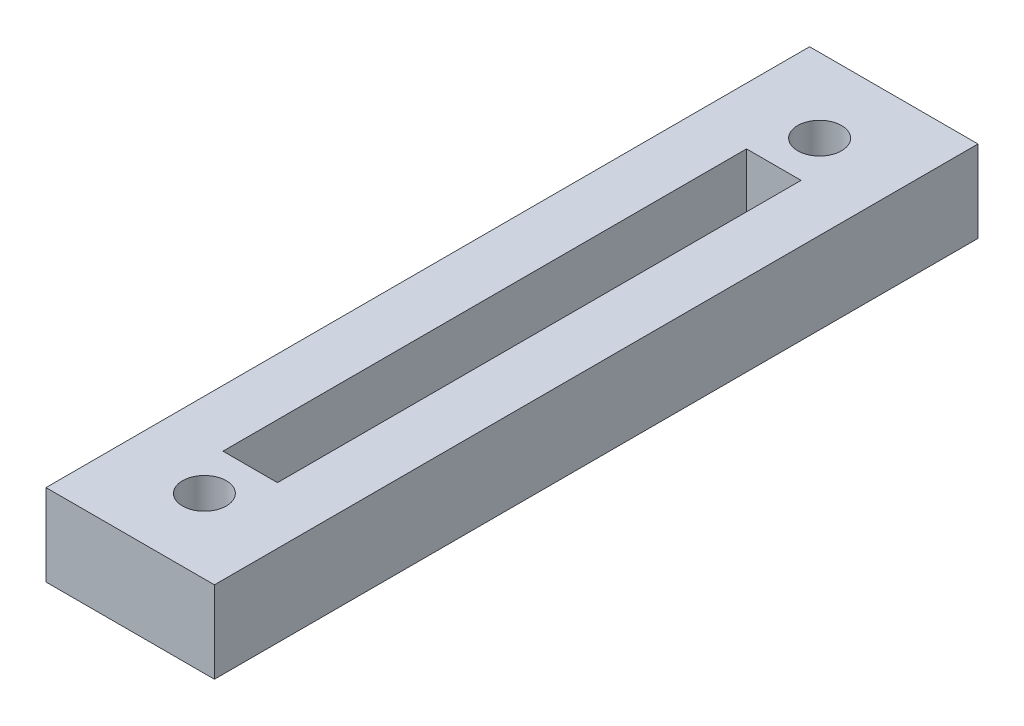
ISO-10303-21;
HEADER;
FILE_DESCRIPTION(('STEP AP214'),'2;1');
FILE_NAME('part.step','',(''),(''),'','','');
FILE_SCHEMA(('AUTOMOTIVE_DESIGN { 1 0 10303 214 1 1 1 1 }'));
ENDSEC;
DATA;
#1=APPLICATION_CONTEXT('core data for automotive mechanical design processes');
#2=APPLICATION_PROTOCOL_DEFINITION('international standard','automotive_design',2000,#1);
#3=PRODUCT_CONTEXT('',#1,'mechanical');
#4=PRODUCT('Part','Part','',(#3));
#5=PRODUCT_RELATED_PRODUCT_CATEGORY('part','',(#4));
#6=PRODUCT_DEFINITION_FORMATION('','',#4);
#7=PRODUCT_DEFINITION_CONTEXT('part definition',#1,'design');
#8=PRODUCT_DEFINITION('design','',#6,#7);
#9=PRODUCT_DEFINITION_SHAPE('','',#8);
#10=(LENGTH_UNIT() NAMED_UNIT(*) SI_UNIT(.MILLI.,.METRE.));
#11=(NAMED_UNIT(*) PLANE_ANGLE_UNIT() SI_UNIT($,.RADIAN.));
#12=(NAMED_UNIT(*) SI_UNIT($,.STERADIAN.) SOLID_ANGLE_UNIT());
#13=UNCERTAINTY_MEASURE_WITH_UNIT(LENGTH_MEASURE(1.E-05),#10,'distance_accuracy_value','');
#14=(GEOMETRIC_REPRESENTATION_CONTEXT(3) GLOBAL_UNCERTAINTY_ASSIGNED_CONTEXT((#13)) GLOBAL_UNIT_ASSIGNED_CONTEXT((#10,
#11,#12)) REPRESENTATION_CONTEXT('',''));
#15=CARTESIAN_POINT('',(0.,0.,0.));
#16=DIRECTION('',(0.,0.,1.));
#17=DIRECTION('',(1.,0.,0.));
#18=AXIS2_PLACEMENT_3D('',#15,#16,#17);
#19=CARTESIAN_POINT('',(0.,9.525,0.));
#20=DIRECTION('',(0.,-1.,0.));
#21=DIRECTION('',(0.,0.,-1.));
#22=AXIS2_PLACEMENT_3D('',#19,#20,#21);
#23=PLANE('',#22);
#24=CARTESIAN_POINT('',(9.8044,9.525,-80.264));
#25=DIRECTION('',(0.,1.,0.));
#26=DIRECTION('',(0.,0.,1.));
#27=AXIS2_PLACEMENT_3D('',#24,#25,#26);
#28=CIRCLE('',#27,2.5527);
#29=CARTESIAN_POINT('',(9.8044,9.525,-77.7113));
#30=VERTEX_POINT('',#29);
#31=EDGE_CURVE('E227',#30,#30,#28,.T.);
#32=ORIENTED_EDGE('',*,*,#31,.F.);
#33=EDGE_LOOP('',(#32));
#34=FACE_BOUND('',#33,.T.);
#35=CARTESIAN_POINT('',(9.8044,9.525,-8.63599999999999));
#36=DIRECTION('',(0.,1.,0.));
#37=DIRECTION('',(0.,0.,1.));
#38=AXIS2_PLACEMENT_3D('',#35,#36,#37);
#39=CIRCLE('',#38,2.5527);
#40=CARTESIAN_POINT('',(9.8044,9.525,-6.0833));
#41=VERTEX_POINT('',#40);
#42=EDGE_CURVE('E135',#41,#41,#39,.T.);
#43=ORIENTED_EDGE('',*,*,#42,.F.);
#44=EDGE_LOOP('',(#43));
#45=FACE_BOUND('',#44,.T.);
#46=DIRECTION('',(-1.,0.,0.));
#47=VECTOR('',#46,1.);
#48=CARTESIAN_POINT('',(6.62939999999999,9.525,-74.93));
#49=LINE('',#48,#47);
#50=CARTESIAN_POINT('',(12.9794,9.525,-74.93));
#51=VERTEX_POINT('',#50);
#52=CARTESIAN_POINT('',(6.62939999999999,9.525,-74.93));
#53=VERTEX_POINT('',#52);
#54=EDGE_CURVE('E141',#51,#53,#49,.T.);
#55=ORIENTED_EDGE('',*,*,#54,.F.);
#56=DIRECTION('',(0.,0.,-1.));
#57=VECTOR('',#56,1.);
#58=CARTESIAN_POINT('',(12.9794,9.525,-74.93));
#59=LINE('',#58,#57);
#60=CARTESIAN_POINT('',(12.9794,9.525,-13.97));
#61=VERTEX_POINT('',#60);
#62=EDGE_CURVE('E50',#61,#51,#59,.T.);
#63=ORIENTED_EDGE('',*,*,#62,.F.);
#64=DIRECTION('',(1.,0.,0.));
#65=VECTOR('',#64,1.);
#66=CARTESIAN_POINT('',(6.6294,9.525,-13.97));
#67=LINE('',#66,#65);
#68=CARTESIAN_POINT('',(6.6294,9.525,-13.97));
#69=VERTEX_POINT('',#68);
#70=EDGE_CURVE('E129',#69,#61,#67,.T.);
#71=ORIENTED_EDGE('',*,*,#70,.F.);
#72=DIRECTION('',(0.,0.,1.));
#73=VECTOR('',#72,1.);
#74=CARTESIAN_POINT('',(6.62939999999999,9.525,-74.93));
#75=LINE('',#74,#73);
#76=EDGE_CURVE('E132',#53,#69,#75,.T.);
#77=ORIENTED_EDGE('',*,*,#76,.F.);
#78=EDGE_LOOP('',(#55,#63,#71,#77));
#79=FACE_BOUND('',#78,.T.);
#80=DIRECTION('',(0.,0.,1.));
#81=VECTOR('',#80,1.);
#82=CARTESIAN_POINT('',(0.,9.525,0.));
#83=LINE('',#82,#81);
#84=CARTESIAN_POINT('',(0.,9.525,-88.9));
#85=VERTEX_POINT('',#84);
#86=CARTESIAN_POINT('',(0.,9.525,0.));
#87=VERTEX_POINT('',#86);
#88=EDGE_CURVE('E151',#85,#87,#83,.T.);
#89=ORIENTED_EDGE('',*,*,#88,.T.);
#90=DIRECTION('',(1.,0.,0.));
#91=VECTOR('',#90,1.);
#92=CARTESIAN_POINT('',(0.,9.525,0.));
#93=LINE('',#92,#91);
#94=CARTESIAN_POINT('',(19.6088,9.525,0.));
#95=VERTEX_POINT('',#94);
#96=EDGE_CURVE('E87',#87,#95,#93,.T.);
#97=ORIENTED_EDGE('',*,*,#96,.T.);
#98=DIRECTION('',(0.,0.,-1.));
#99=VECTOR('',#98,1.);
#100=CARTESIAN_POINT('',(19.6088,9.525,0.));
#101=LINE('',#100,#99);
#102=CARTESIAN_POINT('',(19.6088,9.525,-88.9));
#103=VERTEX_POINT('',#102);
#104=EDGE_CURVE('E154',#95,#103,#101,.T.);
#105=ORIENTED_EDGE('',*,*,#104,.T.);
#106=DIRECTION('',(-1.,0.,0.));
#107=VECTOR('',#106,1.);
#108=CARTESIAN_POINT('',(0.,9.525,-88.9));
#109=LINE('',#108,#107);
#110=EDGE_CURVE('E59',#103,#85,#109,.T.);
#111=ORIENTED_EDGE('',*,*,#110,.T.);
#112=EDGE_LOOP('',(#89,#97,#105,#111));
#113=FACE_BOUND('',#112,.T.);
#114=ADVANCED_FACE('F34',(#34,#45,#79,#113),#23,.F.);
#115=CARTESIAN_POINT('',(0.,0.,0.));
#116=DIRECTION('',(0.,-1.,0.));
#117=DIRECTION('',(0.,0.,-1.));
#118=AXIS2_PLACEMENT_3D('',#115,#116,#117);
#119=PLANE('',#118);
#120=CARTESIAN_POINT('',(9.8044,0.,-80.264));
#121=DIRECTION('',(0.,-1.,0.));
#122=DIRECTION('',(0.,0.,-1.));
#123=AXIS2_PLACEMENT_3D('',#120,#121,#122);
#124=CIRCLE('',#123,2.5527);
#125=CARTESIAN_POINT('',(9.8044,0.,-82.8167));
#126=VERTEX_POINT('',#125);
#127=EDGE_CURVE('E225',#126,#126,#124,.T.);
#128=ORIENTED_EDGE('',*,*,#127,.F.);
#129=EDGE_LOOP('',(#128));
#130=FACE_BOUND('',#129,.T.);
#131=CARTESIAN_POINT('',(9.8044,0.,-8.63599999999999));
#132=DIRECTION('',(0.,-1.,0.));
#133=DIRECTION('',(0.,0.,-1.));
#134=AXIS2_PLACEMENT_3D('',#131,#132,#133);
#135=CIRCLE('',#134,2.5527);
#136=CARTESIAN_POINT('',(9.8044,0.,-11.1887));
#137=VERTEX_POINT('',#136);
#138=EDGE_CURVE('E38',#137,#137,#135,.T.);
#139=ORIENTED_EDGE('',*,*,#138,.F.);
#140=EDGE_LOOP('',(#139));
#141=FACE_BOUND('',#140,.T.);
#142=DIRECTION('',(0.,0.,1.));
#143=VECTOR('',#142,1.);
#144=CARTESIAN_POINT('',(0.,0.,0.));
#145=LINE('',#144,#143);
#146=CARTESIAN_POINT('',(0.,0.,-88.9));
#147=VERTEX_POINT('',#146);
#148=CARTESIAN_POINT('',(0.,0.,0.));
#149=VERTEX_POINT('',#148);
#150=EDGE_CURVE('E147',#147,#149,#145,.T.);
#151=ORIENTED_EDGE('',*,*,#150,.F.);
#152=DIRECTION('',(-1.,0.,0.));
#153=VECTOR('',#152,1.);
#154=CARTESIAN_POINT('',(0.,0.,-88.9));
#155=LINE('',#154,#153);
#156=CARTESIAN_POINT('',(19.6088,0.,-88.9));
#157=VERTEX_POINT('',#156);
#158=EDGE_CURVE('E80',#157,#147,#155,.T.);
#159=ORIENTED_EDGE('',*,*,#158,.F.);
#160=DIRECTION('',(0.,0.,-1.));
#161=VECTOR('',#160,1.);
#162=CARTESIAN_POINT('',(19.6088,0.,0.));
#163=LINE('',#162,#161);
#164=CARTESIAN_POINT('',(19.6088,0.,0.));
#165=VERTEX_POINT('',#164);
#166=EDGE_CURVE('E162',#165,#157,#163,.T.);
#167=ORIENTED_EDGE('',*,*,#166,.F.);
#168=DIRECTION('',(1.,0.,0.));
#169=VECTOR('',#168,1.);
#170=CARTESIAN_POINT('',(0.,0.,0.));
#171=LINE('',#170,#169);
#172=EDGE_CURVE('E160',#149,#165,#171,.T.);
#173=ORIENTED_EDGE('',*,*,#172,.F.);
#174=EDGE_LOOP('',(#151,#159,#167,#173));
#175=FACE_BOUND('',#174,.T.);
#176=ADVANCED_FACE('F176',(#130,#141,#175),#119,.T.);
#177=CARTESIAN_POINT('',(0.,9.525,0.));
#178=DIRECTION('',(1.,0.,0.));
#179=DIRECTION('',(0.,0.,-1.));
#180=AXIS2_PLACEMENT_3D('',#177,#178,#179);
#181=PLANE('',#180);
#182=ORIENTED_EDGE('',*,*,#150,.T.);
#183=DIRECTION('',(0.,-1.,0.));
#184=VECTOR('',#183,1.);
#185=CARTESIAN_POINT('',(0.,9.525,0.));
#186=LINE('',#185,#184);
#187=EDGE_CURVE('E11',#87,#149,#186,.T.);
#188=ORIENTED_EDGE('',*,*,#187,.F.);
#189=ORIENTED_EDGE('',*,*,#88,.F.);
#190=DIRECTION('',(0.,-1.,0.));
#191=VECTOR('',#190,1.);
#192=CARTESIAN_POINT('',(0.,9.525,-88.9));
#193=LINE('',#192,#191);
#194=EDGE_CURVE('E157',#85,#147,#193,.T.);
#195=ORIENTED_EDGE('',*,*,#194,.T.);
#196=EDGE_LOOP('',(#182,#188,#189,#195));
#197=FACE_BOUND('',#196,.T.);
#198=ADVANCED_FACE('F36',(#197),#181,.F.);
#199=CARTESIAN_POINT('',(0.,9.525,0.));
#200=DIRECTION('',(0.,0.,-1.));
#201=DIRECTION('',(-1.,0.,0.));
#202=AXIS2_PLACEMENT_3D('',#199,#200,#201);
#203=PLANE('',#202);
#204=ORIENTED_EDGE('',*,*,#172,.T.);
#205=DIRECTION('',(0.,-1.,0.));
#206=VECTOR('',#205,1.);
#207=CARTESIAN_POINT('',(19.6088,9.525,0.));
#208=LINE('',#207,#206);
#209=EDGE_CURVE('E43',#95,#165,#208,.T.);
#210=ORIENTED_EDGE('',*,*,#209,.F.);
#211=ORIENTED_EDGE('',*,*,#96,.F.);
#212=ORIENTED_EDGE('',*,*,#187,.T.);
#213=EDGE_LOOP('',(#204,#210,#211,#212));
#214=FACE_BOUND('',#213,.T.);
#215=ADVANCED_FACE('F189',(#214),#203,.F.);
#216=CARTESIAN_POINT('',(19.6088,9.525,0.));
#217=DIRECTION('',(-1.,0.,0.));
#218=DIRECTION('',(0.,0.,1.));
#219=AXIS2_PLACEMENT_3D('',#216,#217,#218);
#220=PLANE('',#219);
#221=ORIENTED_EDGE('',*,*,#166,.T.);
#222=DIRECTION('',(0.,-1.,0.));
#223=VECTOR('',#222,1.);
#224=CARTESIAN_POINT('',(19.6088,9.525,-88.9));
#225=LINE('',#224,#223);
#226=EDGE_CURVE('E166',#103,#157,#225,.T.);
#227=ORIENTED_EDGE('',*,*,#226,.F.);
#228=ORIENTED_EDGE('',*,*,#104,.F.);
#229=ORIENTED_EDGE('',*,*,#209,.T.);
#230=EDGE_LOOP('',(#221,#227,#228,#229));
#231=FACE_BOUND('',#230,.T.);
#232=ADVANCED_FACE('F172',(#231),#220,.F.);
#233=CARTESIAN_POINT('',(0.,9.525,-88.9));
#234=DIRECTION('',(0.,0.,1.));
#235=DIRECTION('',(1.,0.,0.));
#236=AXIS2_PLACEMENT_3D('',#233,#234,#235);
#237=PLANE('',#236);
#238=ORIENTED_EDGE('',*,*,#158,.T.);
#239=ORIENTED_EDGE('',*,*,#194,.F.);
#240=ORIENTED_EDGE('',*,*,#110,.F.);
#241=ORIENTED_EDGE('',*,*,#226,.T.);
#242=EDGE_LOOP('',(#238,#239,#240,#241));
#243=FACE_BOUND('',#242,.T.);
#244=ADVANCED_FACE('F180',(#243),#237,.F.);
#245=CARTESIAN_POINT('',(12.9794,3.048,-74.93));
#246=DIRECTION('',(1.,0.,0.));
#247=DIRECTION('',(0.,0.,-1.));
#248=AXIS2_PLACEMENT_3D('',#245,#246,#247);
#249=PLANE('',#248);
#250=ORIENTED_EDGE('',*,*,#62,.T.);
#251=DIRECTION('',(0.,1.,0.));
#252=VECTOR('',#251,1.);
#253=CARTESIAN_POINT('',(12.9794,3.048,-74.93));
#254=LINE('',#253,#252);
#255=CARTESIAN_POINT('',(12.9794,3.048,-74.93));
#256=VERTEX_POINT('',#255);
#257=EDGE_CURVE('E107',#256,#51,#254,.T.);
#258=ORIENTED_EDGE('',*,*,#257,.F.);
#259=DIRECTION('',(0.,0.,-1.));
#260=VECTOR('',#259,1.);
#261=CARTESIAN_POINT('',(12.9794,3.048,-74.93));
#262=LINE('',#261,#260);
#263=CARTESIAN_POINT('',(12.9794,3.048,-13.97));
#264=VERTEX_POINT('',#263);
#265=EDGE_CURVE('E111',#264,#256,#262,.T.);
#266=ORIENTED_EDGE('',*,*,#265,.F.);
#267=DIRECTION('',(0.,1.,0.));
#268=VECTOR('',#267,1.);
#269=CARTESIAN_POINT('',(12.9794,3.048,-13.97));
#270=LINE('',#269,#268);
#271=EDGE_CURVE('E145',#264,#61,#270,.T.);
#272=ORIENTED_EDGE('',*,*,#271,.T.);
#273=EDGE_LOOP('',(#250,#258,#266,#272));
#274=FACE_BOUND('',#273,.T.);
#275=ADVANCED_FACE('F109',(#274),#249,.F.);
#276=CARTESIAN_POINT('',(6.6294,3.048,-13.97));
#277=DIRECTION('',(0.,0.,1.));
#278=DIRECTION('',(1.,0.,0.));
#279=AXIS2_PLACEMENT_3D('',#276,#277,#278);
#280=PLANE('',#279);
#281=ORIENTED_EDGE('',*,*,#70,.T.);
#282=ORIENTED_EDGE('',*,*,#271,.F.);
#283=DIRECTION('',(1.,0.,0.));
#284=VECTOR('',#283,1.);
#285=CARTESIAN_POINT('',(6.6294,3.048,-13.97));
#286=LINE('',#285,#284);
#287=CARTESIAN_POINT('',(6.6294,3.048,-13.97));
#288=VERTEX_POINT('',#287);
#289=EDGE_CURVE('E117',#288,#264,#286,.T.);
#290=ORIENTED_EDGE('',*,*,#289,.F.);
#291=DIRECTION('',(0.,1.,0.));
#292=VECTOR('',#291,1.);
#293=CARTESIAN_POINT('',(6.6294,3.048,-13.97));
#294=LINE('',#293,#292);
#295=EDGE_CURVE('E148',#288,#69,#294,.T.);
#296=ORIENTED_EDGE('',*,*,#295,.T.);
#297=EDGE_LOOP('',(#281,#282,#290,#296));
#298=FACE_BOUND('',#297,.T.);
#299=ADVANCED_FACE('F187',(#298),#280,.F.);
#300=CARTESIAN_POINT('',(6.62939999999999,3.048,-74.93));
#301=DIRECTION('',(-1.,0.,0.));
#302=DIRECTION('',(0.,0.,1.));
#303=AXIS2_PLACEMENT_3D('',#300,#301,#302);
#304=PLANE('',#303);
#305=ORIENTED_EDGE('',*,*,#76,.T.);
#306=ORIENTED_EDGE('',*,*,#295,.F.);
#307=DIRECTION('',(0.,0.,1.));
#308=VECTOR('',#307,1.);
#309=CARTESIAN_POINT('',(6.62939999999999,3.048,-74.93));
#310=LINE('',#309,#308);
#311=CARTESIAN_POINT('',(6.62939999999999,3.048,-74.93));
#312=VERTEX_POINT('',#311);
#313=EDGE_CURVE('E125',#312,#288,#310,.T.);
#314=ORIENTED_EDGE('',*,*,#313,.F.);
#315=DIRECTION('',(0.,1.,0.));
#316=VECTOR('',#315,1.);
#317=CARTESIAN_POINT('',(6.62939999999999,3.048,-74.93));
#318=LINE('',#317,#316);
#319=EDGE_CURVE('E116',#312,#53,#318,.T.);
#320=ORIENTED_EDGE('',*,*,#319,.T.);
#321=EDGE_LOOP('',(#305,#306,#314,#320));
#322=FACE_BOUND('',#321,.T.);
#323=ADVANCED_FACE('F204',(#322),#304,.F.);
#324=CARTESIAN_POINT('',(6.62939999999999,3.048,-74.93));
#325=DIRECTION('',(0.,0.,-1.));
#326=DIRECTION('',(-1.,0.,0.));
#327=AXIS2_PLACEMENT_3D('',#324,#325,#326);
#328=PLANE('',#327);
#329=ORIENTED_EDGE('',*,*,#54,.T.);
#330=ORIENTED_EDGE('',*,*,#319,.F.);
#331=DIRECTION('',(-1.,0.,0.));
#332=VECTOR('',#331,1.);
#333=CARTESIAN_POINT('',(6.62939999999999,3.048,-74.93));
#334=LINE('',#333,#332);
#335=EDGE_CURVE('E120',#256,#312,#334,.T.);
#336=ORIENTED_EDGE('',*,*,#335,.F.);
#337=ORIENTED_EDGE('',*,*,#257,.T.);
#338=EDGE_LOOP('',(#329,#330,#336,#337));
#339=FACE_BOUND('',#338,.T.);
#340=ADVANCED_FACE('F121',(#339),#328,.F.);
#341=CARTESIAN_POINT('',(0.,3.048,0.));
#342=DIRECTION('',(0.,1.,0.));
#343=DIRECTION('',(0.,0.,1.));
#344=AXIS2_PLACEMENT_3D('',#341,#342,#343);
#345=PLANE('',#344);
#346=ORIENTED_EDGE('',*,*,#265,.T.);
#347=ORIENTED_EDGE('',*,*,#335,.T.);
#348=ORIENTED_EDGE('',*,*,#313,.T.);
#349=ORIENTED_EDGE('',*,*,#289,.T.);
#350=EDGE_LOOP('',(#346,#347,#348,#349));
#351=FACE_BOUND('',#350,.T.);
#352=ADVANCED_FACE('F127',(#351),#345,.T.);
#353=CARTESIAN_POINT('',(9.8044,9.525,-8.63599999999999));
#354=DIRECTION('',(0.,1.,0.));
#355=DIRECTION('',(0.,0.,1.));
#356=AXIS2_PLACEMENT_3D('',#353,#354,#355);
#357=CYLINDRICAL_SURFACE('',#356,2.5527);
#358=ORIENTED_EDGE('',*,*,#138,.T.);
#359=EDGE_LOOP('',(#358));
#360=FACE_BOUND('',#359,.T.);
#361=ORIENTED_EDGE('',*,*,#42,.T.);
#362=EDGE_LOOP('',(#361));
#363=FACE_BOUND('',#362,.T.);
#364=ADVANCED_FACE('F213',(#360,#363),#357,.F.);
#365=CARTESIAN_POINT('',(9.8044,9.525,-80.264));
#366=DIRECTION('',(0.,1.,0.));
#367=DIRECTION('',(0.,0.,1.));
#368=AXIS2_PLACEMENT_3D('',#365,#366,#367);
#369=CYLINDRICAL_SURFACE('',#368,2.5527);
#370=ORIENTED_EDGE('',*,*,#127,.T.);
#371=EDGE_LOOP('',(#370));
#372=FACE_BOUND('',#371,.T.);
#373=ORIENTED_EDGE('',*,*,#31,.T.);
#374=EDGE_LOOP('',(#373));
#375=FACE_BOUND('',#374,.T.);
#376=ADVANCED_FACE('F216',(#372,#375),#369,.F.);
#377=CLOSED_SHELL('',(#114,#176,#198,#215,#232,#244,#275,#299,#323,#340,#352,#364,#376));
#378=MANIFOLD_SOLID_BREP('B2',#377);
#379=ADVANCED_BREP_SHAPE_REPRESENTATION('',(#18,#378),#14);
#380=SHAPE_DEFINITION_REPRESENTATION(#9,#379);
ENDSEC;
END-ISO-10303-21;
